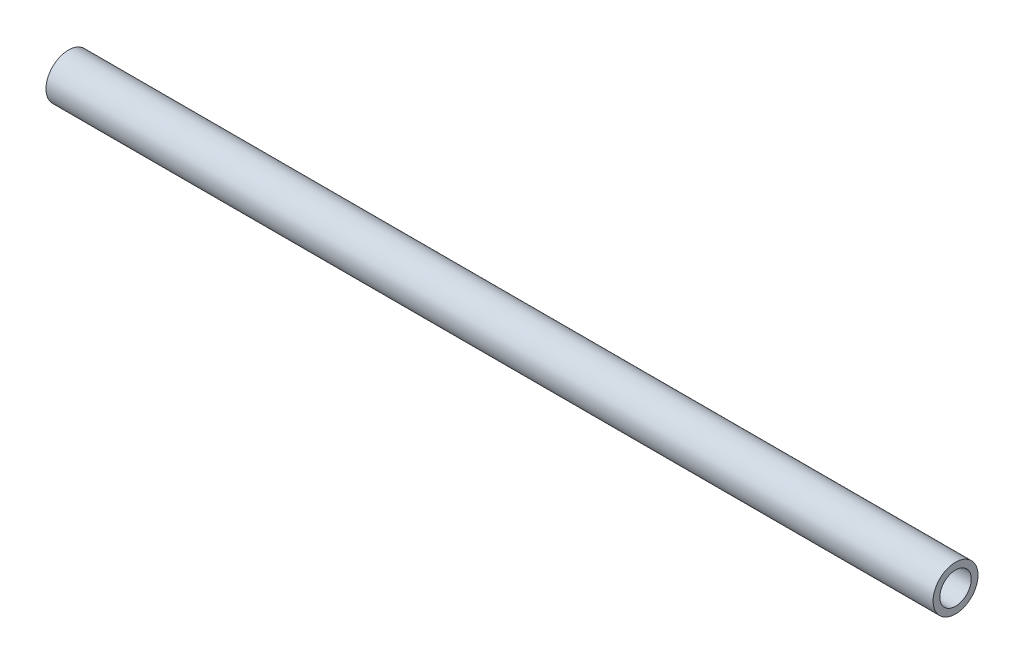
ISO-10303-21;
HEADER;
FILE_DESCRIPTION(('STEP AP214'),'2;1');
FILE_NAME('part.step','',(''),(''),'','','');
FILE_SCHEMA(('AUTOMOTIVE_DESIGN { 1 0 10303 214 1 1 1 1 }'));
ENDSEC;
DATA;
#1=APPLICATION_CONTEXT('core data for automotive mechanical design processes');
#2=APPLICATION_PROTOCOL_DEFINITION('international standard','automotive_design',2000,#1);
#3=PRODUCT_CONTEXT('',#1,'mechanical');
#4=PRODUCT('Part','Part','',(#3));
#5=PRODUCT_RELATED_PRODUCT_CATEGORY('part','',(#4));
#6=PRODUCT_DEFINITION_FORMATION('','',#4);
#7=PRODUCT_DEFINITION_CONTEXT('part definition',#1,'design');
#8=PRODUCT_DEFINITION('design','',#6,#7);
#9=PRODUCT_DEFINITION_SHAPE('','',#8);
#10=(LENGTH_UNIT() NAMED_UNIT(*) SI_UNIT(.MILLI.,.METRE.));
#11=(NAMED_UNIT(*) PLANE_ANGLE_UNIT() SI_UNIT($,.RADIAN.));
#12=(NAMED_UNIT(*) SI_UNIT($,.STERADIAN.) SOLID_ANGLE_UNIT());
#13=UNCERTAINTY_MEASURE_WITH_UNIT(LENGTH_MEASURE(1.E-05),#10,'distance_accuracy_value','');
#14=(GEOMETRIC_REPRESENTATION_CONTEXT(3) GLOBAL_UNCERTAINTY_ASSIGNED_CONTEXT((#13)) GLOBAL_UNIT_ASSIGNED_CONTEXT((#10,
#11,#12)) REPRESENTATION_CONTEXT('',''));
#15=CARTESIAN_POINT('',(0.,0.,0.));
#16=DIRECTION('',(0.,0.,1.));
#17=DIRECTION('',(1.,0.,0.));
#18=AXIS2_PLACEMENT_3D('',#15,#16,#17);
#19=CARTESIAN_POINT('',(0.,0.,0.));
#20=DIRECTION('',(1.,0.,0.));
#21=DIRECTION('',(0.,0.,-1.));
#22=AXIS2_PLACEMENT_3D('',#19,#20,#21);
#23=PLANE('',#22);
#24=CARTESIAN_POINT('',(0.,0.,0.));
#25=DIRECTION('',(1.,0.,0.));
#26=DIRECTION('',(0.,0.,-1.));
#27=AXIS2_PLACEMENT_3D('',#24,#25,#26);
#28=CIRCLE('',#27,7.);
#29=CARTESIAN_POINT('',(0.,0.,-7.));
#30=VERTEX_POINT('',#29);
#31=EDGE_CURVE('E56',#30,#30,#28,.T.);
#32=ORIENTED_EDGE('',*,*,#31,.T.);
#33=EDGE_LOOP('',(#32));
#34=FACE_BOUND('',#33,.T.);
#35=CARTESIAN_POINT('',(0.,0.,0.));
#36=DIRECTION('',(1.,0.,0.));
#37=DIRECTION('',(0.,0.,-1.));
#38=AXIS2_PLACEMENT_3D('',#35,#36,#37);
#39=CIRCLE('',#38,10.);
#40=CARTESIAN_POINT('',(0.,0.,-10.));
#41=VERTEX_POINT('',#40);
#42=EDGE_CURVE('E45',#41,#41,#39,.T.);
#43=ORIENTED_EDGE('',*,*,#42,.F.);
#44=EDGE_LOOP('',(#43));
#45=FACE_BOUND('',#44,.T.);
#46=ADVANCED_FACE('F41',(#34,#45),#23,.F.);
#47=CARTESIAN_POINT('',(395.,0.,0.));
#48=DIRECTION('',(1.,0.,0.));
#49=DIRECTION('',(0.,0.,-1.));
#50=AXIS2_PLACEMENT_3D('',#47,#48,#49);
#51=PLANE('',#50);
#52=CARTESIAN_POINT('',(395.,0.,0.));
#53=DIRECTION('',(1.,0.,0.));
#54=DIRECTION('',(0.,0.,-1.));
#55=AXIS2_PLACEMENT_3D('',#52,#53,#54);
#56=CIRCLE('',#55,7.);
#57=CARTESIAN_POINT('',(395.,0.,-7.));
#58=VERTEX_POINT('',#57);
#59=EDGE_CURVE('E52',#58,#58,#56,.T.);
#60=ORIENTED_EDGE('',*,*,#59,.F.);
#61=EDGE_LOOP('',(#60));
#62=FACE_BOUND('',#61,.T.);
#63=CARTESIAN_POINT('',(395.,0.,0.));
#64=DIRECTION('',(1.,0.,0.));
#65=DIRECTION('',(0.,0.,-1.));
#66=AXIS2_PLACEMENT_3D('',#63,#64,#65);
#67=CIRCLE('',#66,10.);
#68=CARTESIAN_POINT('',(395.,0.,-10.));
#69=VERTEX_POINT('',#68);
#70=EDGE_CURVE('E11',#69,#69,#67,.T.);
#71=ORIENTED_EDGE('',*,*,#70,.T.);
#72=EDGE_LOOP('',(#71));
#73=FACE_BOUND('',#72,.T.);
#74=ADVANCED_FACE('F69',(#62,#73),#51,.T.);
#75=CARTESIAN_POINT('',(0.,0.,0.));
#76=DIRECTION('',(1.,0.,0.));
#77=DIRECTION('',(0.,0.,-1.));
#78=AXIS2_PLACEMENT_3D('',#75,#76,#77);
#79=CYLINDRICAL_SURFACE('',#78,10.);
#80=ORIENTED_EDGE('',*,*,#70,.F.);
#81=EDGE_LOOP('',(#80));
#82=FACE_BOUND('',#81,.T.);
#83=ORIENTED_EDGE('',*,*,#42,.T.);
#84=EDGE_LOOP('',(#83));
#85=FACE_BOUND('',#84,.T.);
#86=ADVANCED_FACE('F43',(#82,#85),#79,.T.);
#87=CARTESIAN_POINT('',(0.,0.,0.));
#88=DIRECTION('',(1.,0.,0.));
#89=DIRECTION('',(0.,0.,-1.));
#90=AXIS2_PLACEMENT_3D('',#87,#88,#89);
#91=CYLINDRICAL_SURFACE('',#90,7.);
#92=ORIENTED_EDGE('',*,*,#59,.T.);
#93=EDGE_LOOP('',(#92));
#94=FACE_BOUND('',#93,.T.);
#95=ORIENTED_EDGE('',*,*,#31,.F.);
#96=EDGE_LOOP('',(#95));
#97=FACE_BOUND('',#96,.T.);
#98=ADVANCED_FACE('F62',(#94,#97),#91,.F.);
#99=CLOSED_SHELL('',(#46,#74,#86,#98));
#100=MANIFOLD_SOLID_BREP('B2',#99);
#101=ADVANCED_BREP_SHAPE_REPRESENTATION('',(#18,#100),#14);
#102=SHAPE_DEFINITION_REPRESENTATION(#9,#101);
ENDSEC;
END-ISO-10303-21;
